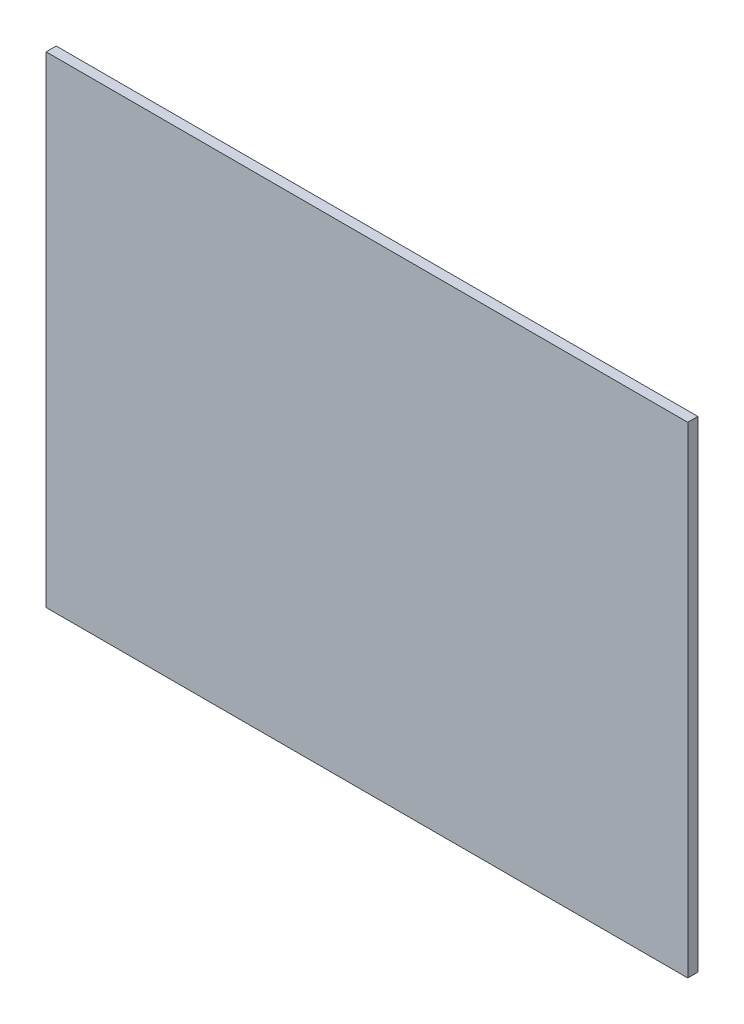
ISO-10303-21;
HEADER;
FILE_DESCRIPTION(('STEP AP214'),'2;1');
FILE_NAME('part.step','',(''),(''),'','','');
FILE_SCHEMA(('AUTOMOTIVE_DESIGN { 1 0 10303 214 1 1 1 1 }'));
ENDSEC;
DATA;
#1=APPLICATION_CONTEXT('core data for automotive mechanical design processes');
#2=APPLICATION_PROTOCOL_DEFINITION('international standard','automotive_design',2000,#1);
#3=PRODUCT_CONTEXT('',#1,'mechanical');
#4=PRODUCT('Part','Part','',(#3));
#5=PRODUCT_RELATED_PRODUCT_CATEGORY('part','',(#4));
#6=PRODUCT_DEFINITION_FORMATION('','',#4);
#7=PRODUCT_DEFINITION_CONTEXT('part definition',#1,'design');
#8=PRODUCT_DEFINITION('design','',#6,#7);
#9=PRODUCT_DEFINITION_SHAPE('','',#8);
#10=(LENGTH_UNIT() NAMED_UNIT(*) SI_UNIT(.MILLI.,.METRE.));
#11=(NAMED_UNIT(*) PLANE_ANGLE_UNIT() SI_UNIT($,.RADIAN.));
#12=(NAMED_UNIT(*) SI_UNIT($,.STERADIAN.) SOLID_ANGLE_UNIT());
#13=UNCERTAINTY_MEASURE_WITH_UNIT(LENGTH_MEASURE(1.E-05),#10,'distance_accuracy_value','');
#14=(GEOMETRIC_REPRESENTATION_CONTEXT(3) GLOBAL_UNCERTAINTY_ASSIGNED_CONTEXT((#13)) GLOBAL_UNIT_ASSIGNED_CONTEXT((#10,
#11,#12)) REPRESENTATION_CONTEXT('',''));
#15=CARTESIAN_POINT('',(0.,0.,0.));
#16=DIRECTION('',(0.,0.,1.));
#17=DIRECTION('',(1.,0.,0.));
#18=AXIS2_PLACEMENT_3D('',#15,#16,#17);
#19=CARTESIAN_POINT('',(-12.7,9.525,0.4));
#20=DIRECTION('',(1.,0.,0.));
#21=DIRECTION('',(0.,1.,0.));
#22=AXIS2_PLACEMENT_3D('',#19,#20,#21);
#23=PLANE('',#22);
#24=DIRECTION('',(0.,-1.,0.));
#25=VECTOR('',#24,1.);
#26=CARTESIAN_POINT('',(-12.7,9.525,0.));
#27=LINE('',#26,#25);
#28=CARTESIAN_POINT('',(-12.7,9.525,0.));
#29=VERTEX_POINT('',#28);
#30=CARTESIAN_POINT('',(-12.7,-9.525,0.));
#31=VERTEX_POINT('',#30);
#32=EDGE_CURVE('E96',#29,#31,#27,.T.);
#33=ORIENTED_EDGE('',*,*,#32,.T.);
#34=DIRECTION('',(0.,0.,-1.));
#35=VECTOR('',#34,1.);
#36=CARTESIAN_POINT('',(-12.7,-9.525,0.4));
#37=LINE('',#36,#35);
#38=CARTESIAN_POINT('',(-12.7,-9.525,0.4));
#39=VERTEX_POINT('',#38);
#40=EDGE_CURVE('E11',#39,#31,#37,.T.);
#41=ORIENTED_EDGE('',*,*,#40,.F.);
#42=DIRECTION('',(0.,-1.,0.));
#43=VECTOR('',#42,1.);
#44=CARTESIAN_POINT('',(-12.7,9.525,0.4));
#45=LINE('',#44,#43);
#46=CARTESIAN_POINT('',(-12.7,9.525,0.4));
#47=VERTEX_POINT('',#46);
#48=EDGE_CURVE('E84',#47,#39,#45,.T.);
#49=ORIENTED_EDGE('',*,*,#48,.F.);
#50=DIRECTION('',(0.,0.,-1.));
#51=VECTOR('',#50,1.);
#52=CARTESIAN_POINT('',(-12.7,9.525,0.4));
#53=LINE('',#52,#51);
#54=EDGE_CURVE('E92',#47,#29,#53,.T.);
#55=ORIENTED_EDGE('',*,*,#54,.T.);
#56=EDGE_LOOP('',(#33,#41,#49,#55));
#57=FACE_BOUND('',#56,.T.);
#58=ADVANCED_FACE('F33',(#57),#23,.F.);
#59=CARTESIAN_POINT('',(12.7,-9.525,0.4));
#60=DIRECTION('',(0.,1.,0.));
#61=DIRECTION('',(-1.,0.,0.));
#62=AXIS2_PLACEMENT_3D('',#59,#60,#61);
#63=PLANE('',#62);
#64=DIRECTION('',(1.,0.,0.));
#65=VECTOR('',#64,1.);
#66=CARTESIAN_POINT('',(12.7,-9.525,0.));
#67=LINE('',#66,#65);
#68=CARTESIAN_POINT('',(12.7,-9.525,0.));
#69=VERTEX_POINT('',#68);
#70=EDGE_CURVE('E88',#31,#69,#67,.T.);
#71=ORIENTED_EDGE('',*,*,#70,.T.);
#72=DIRECTION('',(0.,0.,-1.));
#73=VECTOR('',#72,1.);
#74=CARTESIAN_POINT('',(12.7,-9.525,0.4));
#75=LINE('',#74,#73);
#76=CARTESIAN_POINT('',(12.7,-9.525,0.4));
#77=VERTEX_POINT('',#76);
#78=EDGE_CURVE('E41',#77,#69,#75,.T.);
#79=ORIENTED_EDGE('',*,*,#78,.F.);
#80=DIRECTION('',(1.,0.,0.));
#81=VECTOR('',#80,1.);
#82=CARTESIAN_POINT('',(12.7,-9.525,0.4));
#83=LINE('',#82,#81);
#84=EDGE_CURVE('E79',#39,#77,#83,.T.);
#85=ORIENTED_EDGE('',*,*,#84,.F.);
#86=ORIENTED_EDGE('',*,*,#40,.T.);
#87=EDGE_LOOP('',(#71,#79,#85,#86));
#88=FACE_BOUND('',#87,.T.);
#89=ADVANCED_FACE('F87',(#88),#63,.F.);
#90=CARTESIAN_POINT('',(12.7,9.525,0.4));
#91=DIRECTION('',(-1.,0.,0.));
#92=DIRECTION('',(0.,-1.,0.));
#93=AXIS2_PLACEMENT_3D('',#90,#91,#92);
#94=PLANE('',#93);
#95=DIRECTION('',(0.,1.,0.));
#96=VECTOR('',#95,1.);
#97=CARTESIAN_POINT('',(12.7,9.525,0.));
#98=LINE('',#97,#96);
#99=CARTESIAN_POINT('',(12.7,9.525,0.));
#100=VERTEX_POINT('',#99);
#101=EDGE_CURVE('E66',#69,#100,#98,.T.);
#102=ORIENTED_EDGE('',*,*,#101,.T.);
#103=DIRECTION('',(0.,0.,-1.));
#104=VECTOR('',#103,1.);
#105=CARTESIAN_POINT('',(12.7,9.525,0.4));
#106=LINE('',#105,#104);
#107=CARTESIAN_POINT('',(12.7,9.525,0.4));
#108=VERTEX_POINT('',#107);
#109=EDGE_CURVE('E89',#108,#100,#106,.T.);
#110=ORIENTED_EDGE('',*,*,#109,.F.);
#111=DIRECTION('',(0.,1.,0.));
#112=VECTOR('',#111,1.);
#113=CARTESIAN_POINT('',(12.7,9.525,0.4));
#114=LINE('',#113,#112);
#115=EDGE_CURVE('E82',#77,#108,#114,.T.);
#116=ORIENTED_EDGE('',*,*,#115,.F.);
#117=ORIENTED_EDGE('',*,*,#78,.T.);
#118=EDGE_LOOP('',(#102,#110,#116,#117));
#119=FACE_BOUND('',#118,.T.);
#120=ADVANCED_FACE('F90',(#119),#94,.F.);
#121=CARTESIAN_POINT('',(12.7,9.525,0.4));
#122=DIRECTION('',(0.,-1.,0.));
#123=DIRECTION('',(1.,0.,0.));
#124=AXIS2_PLACEMENT_3D('',#121,#122,#123);
#125=PLANE('',#124);
#126=DIRECTION('',(-1.,0.,0.));
#127=VECTOR('',#126,1.);
#128=CARTESIAN_POINT('',(12.7,9.525,0.));
#129=LINE('',#128,#127);
#130=EDGE_CURVE('E72',#100,#29,#129,.T.);
#131=ORIENTED_EDGE('',*,*,#130,.T.);
#132=ORIENTED_EDGE('',*,*,#54,.F.);
#133=DIRECTION('',(-1.,0.,0.));
#134=VECTOR('',#133,1.);
#135=CARTESIAN_POINT('',(12.7,9.525,0.4));
#136=LINE('',#135,#134);
#137=EDGE_CURVE('E49',#108,#47,#136,.T.);
#138=ORIENTED_EDGE('',*,*,#137,.F.);
#139=ORIENTED_EDGE('',*,*,#109,.T.);
#140=EDGE_LOOP('',(#131,#132,#138,#139));
#141=FACE_BOUND('',#140,.T.);
#142=ADVANCED_FACE('F103',(#141),#125,.F.);
#143=CARTESIAN_POINT('',(0.,0.,0.4));
#144=DIRECTION('',(0.,0.,-1.));
#145=DIRECTION('',(-1.,0.,0.));
#146=AXIS2_PLACEMENT_3D('',#143,#144,#145);
#147=PLANE('',#146);
#148=ORIENTED_EDGE('',*,*,#48,.T.);
#149=ORIENTED_EDGE('',*,*,#84,.T.);
#150=ORIENTED_EDGE('',*,*,#115,.T.);
#151=ORIENTED_EDGE('',*,*,#137,.T.);
#152=EDGE_LOOP('',(#148,#149,#150,#151));
#153=FACE_BOUND('',#152,.T.);
#154=ADVANCED_FACE('F80',(#153),#147,.F.);
#155=CARTESIAN_POINT('',(0.,0.,0.));
#156=DIRECTION('',(0.,0.,-1.));
#157=DIRECTION('',(-1.,0.,0.));
#158=AXIS2_PLACEMENT_3D('',#155,#156,#157);
#159=PLANE('',#158);
#160=ORIENTED_EDGE('',*,*,#32,.F.);
#161=ORIENTED_EDGE('',*,*,#130,.F.);
#162=ORIENTED_EDGE('',*,*,#101,.F.);
#163=ORIENTED_EDGE('',*,*,#70,.F.);
#164=EDGE_LOOP('',(#160,#161,#162,#163));
#165=FACE_BOUND('',#164,.T.);
#166=ADVANCED_FACE('F106',(#165),#159,.T.);
#167=CLOSED_SHELL('',(#58,#89,#120,#142,#154,#166));
#168=MANIFOLD_SOLID_BREP('B2',#167);
#169=ADVANCED_BREP_SHAPE_REPRESENTATION('',(#18,#168),#14);
#170=SHAPE_DEFINITION_REPRESENTATION(#9,#169);
ENDSEC;
END-ISO-10303-21;
